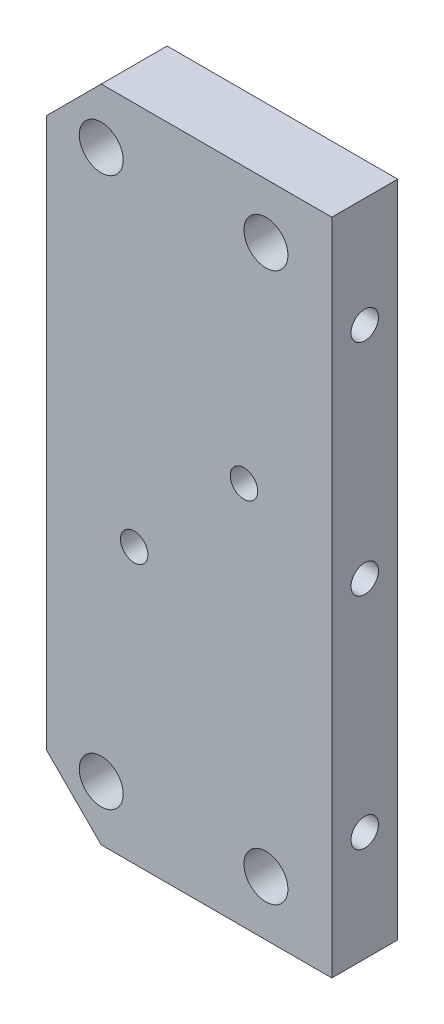
ISO-10303-21;
HEADER;
FILE_DESCRIPTION(('STEP AP214'),'2;1');
FILE_NAME('part.step','',(''),(''),'','','');
FILE_SCHEMA(('AUTOMOTIVE_DESIGN { 1 0 10303 214 1 1 1 1 }'));
ENDSEC;
DATA;
#1=APPLICATION_CONTEXT('core data for automotive mechanical design processes');
#2=APPLICATION_PROTOCOL_DEFINITION('international standard','automotive_design',2000,#1);
#3=PRODUCT_CONTEXT('',#1,'mechanical');
#4=PRODUCT('Part','Part','',(#3));
#5=PRODUCT_RELATED_PRODUCT_CATEGORY('part','',(#4));
#6=PRODUCT_DEFINITION_FORMATION('','',#4);
#7=PRODUCT_DEFINITION_CONTEXT('part definition',#1,'design');
#8=PRODUCT_DEFINITION('design','',#6,#7);
#9=PRODUCT_DEFINITION_SHAPE('','',#8);
#10=(LENGTH_UNIT() NAMED_UNIT(*) SI_UNIT(.MILLI.,.METRE.));
#11=(NAMED_UNIT(*) PLANE_ANGLE_UNIT() SI_UNIT($,.RADIAN.));
#12=(NAMED_UNIT(*) SI_UNIT($,.STERADIAN.) SOLID_ANGLE_UNIT());
#13=UNCERTAINTY_MEASURE_WITH_UNIT(LENGTH_MEASURE(1.E-05),#10,'distance_accuracy_value','');
#14=(GEOMETRIC_REPRESENTATION_CONTEXT(3) GLOBAL_UNCERTAINTY_ASSIGNED_CONTEXT((#13)) GLOBAL_UNIT_ASSIGNED_CONTEXT((#10,
#11,#12)) REPRESENTATION_CONTEXT('',''));
#15=CARTESIAN_POINT('',(0.,0.,0.));
#16=DIRECTION('',(0.,0.,1.));
#17=DIRECTION('',(1.,0.,0.));
#18=AXIS2_PLACEMENT_3D('',#15,#16,#17);
#19=CARTESIAN_POINT('',(-13.,-30.,6.));
#20=DIRECTION('',(1.,0.,0.));
#21=DIRECTION('',(0.,0.,-1.));
#22=AXIS2_PLACEMENT_3D('',#19,#20,#21);
#23=PLANE('',#22);
#24=DIRECTION('',(0.,-1.,0.));
#25=VECTOR('',#24,1.);
#26=CARTESIAN_POINT('',(-13.,-30.,6.));
#27=LINE('',#26,#25);
#28=CARTESIAN_POINT('',(-13.,25.,6.));
#29=VERTEX_POINT('',#28);
#30=CARTESIAN_POINT('',(-13.,-25.,6.));
#31=VERTEX_POINT('',#30);
#32=EDGE_CURVE('E179',#29,#31,#27,.T.);
#33=ORIENTED_EDGE('',*,*,#32,.F.);
#34=DIRECTION('',(0.,0.,-1.));
#35=VECTOR('',#34,1.);
#36=CARTESIAN_POINT('',(-13.,25.,6.));
#37=LINE('',#36,#35);
#38=CARTESIAN_POINT('',(-13.,25.,0.));
#39=VERTEX_POINT('',#38);
#40=EDGE_CURVE('E214',#29,#39,#37,.T.);
#41=ORIENTED_EDGE('',*,*,#40,.T.);
#42=DIRECTION('',(0.,-1.,0.));
#43=VECTOR('',#42,1.);
#44=CARTESIAN_POINT('',(-13.,-30.,0.));
#45=LINE('',#44,#43);
#46=CARTESIAN_POINT('',(-13.,-25.,0.));
#47=VERTEX_POINT('',#46);
#48=EDGE_CURVE('E178',#39,#47,#45,.T.);
#49=ORIENTED_EDGE('',*,*,#48,.T.);
#50=DIRECTION('',(0.,0.,1.));
#51=VECTOR('',#50,1.);
#52=CARTESIAN_POINT('',(-13.,-25.,6.));
#53=LINE('',#52,#51);
#54=EDGE_CURVE('E211',#47,#31,#53,.T.);
#55=ORIENTED_EDGE('',*,*,#54,.T.);
#56=EDGE_LOOP('',(#33,#41,#49,#55));
#57=FACE_BOUND('',#56,.T.);
#58=ADVANCED_FACE('F44',(#57),#23,.F.);
#59=CARTESIAN_POINT('',(13.,-30.,6.));
#60=DIRECTION('',(0.,1.,0.));
#61=DIRECTION('',(0.,0.,1.));
#62=AXIS2_PLACEMENT_3D('',#59,#60,#61);
#63=PLANE('',#62);
#64=DIRECTION('',(1.,0.,0.));
#65=VECTOR('',#64,1.);
#66=CARTESIAN_POINT('',(13.,-30.,6.));
#67=LINE('',#66,#65);
#68=CARTESIAN_POINT('',(-7.99999999999999,-30.,6.));
#69=VERTEX_POINT('',#68);
#70=CARTESIAN_POINT('',(13.,-30.,6.));
#71=VERTEX_POINT('',#70);
#72=EDGE_CURVE('E182',#69,#71,#67,.T.);
#73=ORIENTED_EDGE('',*,*,#72,.F.);
#74=DIRECTION('',(0.,0.,-1.));
#75=VECTOR('',#74,1.);
#76=CARTESIAN_POINT('',(-8.,-30.,6.));
#77=LINE('',#76,#75);
#78=CARTESIAN_POINT('',(-7.99999999999999,-30.,0.));
#79=VERTEX_POINT('',#78);
#80=EDGE_CURVE('E11',#69,#79,#77,.T.);
#81=ORIENTED_EDGE('',*,*,#80,.T.);
#82=DIRECTION('',(1.,0.,0.));
#83=VECTOR('',#82,1.);
#84=CARTESIAN_POINT('',(13.,-30.,0.));
#85=LINE('',#84,#83);
#86=CARTESIAN_POINT('',(13.,-30.,0.));
#87=VERTEX_POINT('',#86);
#88=EDGE_CURVE('E196',#79,#87,#85,.T.);
#89=ORIENTED_EDGE('',*,*,#88,.T.);
#90=DIRECTION('',(0.,0.,-1.));
#91=VECTOR('',#90,1.);
#92=CARTESIAN_POINT('',(13.,-30.,6.));
#93=LINE('',#92,#91);
#94=EDGE_CURVE('E207',#71,#87,#93,.T.);
#95=ORIENTED_EDGE('',*,*,#94,.F.);
#96=EDGE_LOOP('',(#73,#81,#89,#95));
#97=FACE_BOUND('',#96,.T.);
#98=ADVANCED_FACE('F249',(#97),#63,.F.);
#99=CARTESIAN_POINT('',(13.,-30.,6.));
#100=DIRECTION('',(-1.,0.,0.));
#101=DIRECTION('',(0.,0.,1.));
#102=AXIS2_PLACEMENT_3D('',#99,#100,#101);
#103=PLANE('',#102);
#104=CARTESIAN_POINT('',(13.,20.,2.99999999999999));
#105=DIRECTION('',(1.,0.,0.));
#106=DIRECTION('',(0.,0.,-1.));
#107=AXIS2_PLACEMENT_3D('',#104,#105,#106);
#108=CIRCLE('',#107,1.24999999999999);
#109=CARTESIAN_POINT('',(13.,20.,1.75));
#110=VERTEX_POINT('',#109);
#111=EDGE_CURVE('E121',#110,#110,#108,.T.);
#112=ORIENTED_EDGE('',*,*,#111,.F.);
#113=EDGE_LOOP('',(#112));
#114=FACE_BOUND('',#113,.T.);
#115=CARTESIAN_POINT('',(13.,0.,2.99999999999999));
#116=DIRECTION('',(1.,0.,0.));
#117=DIRECTION('',(0.,0.,-1.));
#118=AXIS2_PLACEMENT_3D('',#115,#116,#117);
#119=CIRCLE('',#118,1.24999999999999);
#120=CARTESIAN_POINT('',(13.,0.,1.75));
#121=VERTEX_POINT('',#120);
#122=EDGE_CURVE('E120',#121,#121,#119,.T.);
#123=ORIENTED_EDGE('',*,*,#122,.F.);
#124=EDGE_LOOP('',(#123));
#125=FACE_BOUND('',#124,.T.);
#126=CARTESIAN_POINT('',(13.,-20.,2.99999999999999));
#127=DIRECTION('',(1.,0.,0.));
#128=DIRECTION('',(0.,0.,-1.));
#129=AXIS2_PLACEMENT_3D('',#126,#127,#128);
#130=CIRCLE('',#129,1.24999999999999);
#131=CARTESIAN_POINT('',(13.,-20.,1.75));
#132=VERTEX_POINT('',#131);
#133=EDGE_CURVE('E139',#132,#132,#130,.T.);
#134=ORIENTED_EDGE('',*,*,#133,.F.);
#135=EDGE_LOOP('',(#134));
#136=FACE_BOUND('',#135,.T.);
#137=DIRECTION('',(0.,1.,0.));
#138=VECTOR('',#137,1.);
#139=CARTESIAN_POINT('',(13.,-30.,0.));
#140=LINE('',#139,#138);
#141=CARTESIAN_POINT('',(13.,30.,0.));
#142=VERTEX_POINT('',#141);
#143=EDGE_CURVE('E199',#87,#142,#140,.T.);
#144=ORIENTED_EDGE('',*,*,#143,.T.);
#145=DIRECTION('',(0.,0.,-1.));
#146=VECTOR('',#145,1.);
#147=CARTESIAN_POINT('',(13.,30.,6.));
#148=LINE('',#147,#146);
#149=CARTESIAN_POINT('',(13.,30.,6.));
#150=VERTEX_POINT('',#149);
#151=EDGE_CURVE('E192',#150,#142,#148,.T.);
#152=ORIENTED_EDGE('',*,*,#151,.F.);
#153=DIRECTION('',(0.,1.,0.));
#154=VECTOR('',#153,1.);
#155=CARTESIAN_POINT('',(13.,-30.,6.));
#156=LINE('',#155,#154);
#157=EDGE_CURVE('E186',#71,#150,#156,.T.);
#158=ORIENTED_EDGE('',*,*,#157,.F.);
#159=ORIENTED_EDGE('',*,*,#94,.T.);
#160=EDGE_LOOP('',(#144,#152,#158,#159));
#161=FACE_BOUND('',#160,.T.);
#162=ADVANCED_FACE('F245',(#114,#125,#136,#161),#103,.F.);
#163=CARTESIAN_POINT('',(13.,30.,6.));
#164=DIRECTION('',(0.,-1.,0.));
#165=DIRECTION('',(1.,0.,0.));
#166=AXIS2_PLACEMENT_3D('',#163,#164,#165);
#167=PLANE('',#166);
#168=DIRECTION('',(-1.,0.,0.));
#169=VECTOR('',#168,1.);
#170=CARTESIAN_POINT('',(13.,30.,0.));
#171=LINE('',#170,#169);
#172=CARTESIAN_POINT('',(-7.99999999999997,30.,0.));
#173=VERTEX_POINT('',#172);
#174=EDGE_CURVE('E183',#142,#173,#171,.T.);
#175=ORIENTED_EDGE('',*,*,#174,.T.);
#176=DIRECTION('',(0.,0.,1.));
#177=VECTOR('',#176,1.);
#178=CARTESIAN_POINT('',(-7.99999999999998,30.,6.));
#179=LINE('',#178,#177);
#180=CARTESIAN_POINT('',(-7.99999999999997,30.,6.));
#181=VERTEX_POINT('',#180);
#182=EDGE_CURVE('E69',#173,#181,#179,.T.);
#183=ORIENTED_EDGE('',*,*,#182,.T.);
#184=DIRECTION('',(-1.,0.,0.));
#185=VECTOR('',#184,1.);
#186=CARTESIAN_POINT('',(13.,30.,6.));
#187=LINE('',#186,#185);
#188=EDGE_CURVE('E189',#150,#181,#187,.T.);
#189=ORIENTED_EDGE('',*,*,#188,.F.);
#190=ORIENTED_EDGE('',*,*,#151,.T.);
#191=EDGE_LOOP('',(#175,#183,#189,#190));
#192=FACE_BOUND('',#191,.T.);
#193=ADVANCED_FACE('F241',(#192),#167,.F.);
#194=CARTESIAN_POINT('',(0.,0.,6.));
#195=DIRECTION('',(0.,0.,1.));
#196=DIRECTION('',(1.,0.,0.));
#197=AXIS2_PLACEMENT_3D('',#194,#195,#196);
#198=PLANE('',#197);
#199=CARTESIAN_POINT('',(5.00000000000293,5.00000000001032,6.));
#200=DIRECTION('',(0.,0.,1.));
#201=DIRECTION('',(1.,0.,0.));
#202=AXIS2_PLACEMENT_3D('',#199,#200,#201);
#203=CIRCLE('',#202,1.24999999999999);
#204=CARTESIAN_POINT('',(6.25000000000292,5.00000000001032,6.));
#205=VERTEX_POINT('',#204);
#206=EDGE_CURVE('E319',#205,#205,#203,.T.);
#207=ORIENTED_EDGE('',*,*,#206,.F.);
#208=EDGE_LOOP('',(#207));
#209=FACE_BOUND('',#208,.T.);
#210=CARTESIAN_POINT('',(-4.99999999999702,-4.99999999998973,6.));
#211=DIRECTION('',(0.,0.,1.));
#212=DIRECTION('',(1.,0.,0.));
#213=AXIS2_PLACEMENT_3D('',#210,#211,#212);
#214=CIRCLE('',#213,1.24999999999999);
#215=CARTESIAN_POINT('',(-3.74999999999704,-4.99999999998973,6.));
#216=VERTEX_POINT('',#215);
#217=EDGE_CURVE('E323',#216,#216,#214,.T.);
#218=ORIENTED_EDGE('',*,*,#217,.F.);
#219=EDGE_LOOP('',(#218));
#220=FACE_BOUND('',#219,.T.);
#221=CARTESIAN_POINT('',(6.99999999999981,-25.,6.));
#222=DIRECTION('',(0.,0.,1.));
#223=DIRECTION('',(1.,0.,0.));
#224=AXIS2_PLACEMENT_3D('',#221,#222,#223);
#225=CIRCLE('',#224,2.);
#226=CARTESIAN_POINT('',(8.99999999999981,-25.,6.));
#227=VERTEX_POINT('',#226);
#228=EDGE_CURVE('E152',#227,#227,#225,.F.);
#229=ORIENTED_EDGE('',*,*,#228,.T.);
#230=EDGE_LOOP('',(#229));
#231=FACE_BOUND('',#230,.T.);
#232=CARTESIAN_POINT('',(-8.00000000000002,25.,6.));
#233=DIRECTION('',(0.,0.,1.));
#234=DIRECTION('',(1.,0.,0.));
#235=AXIS2_PLACEMENT_3D('',#232,#233,#234);
#236=CIRCLE('',#235,2.);
#237=CARTESIAN_POINT('',(-6.00000000000002,25.,6.));
#238=VERTEX_POINT('',#237);
#239=EDGE_CURVE('E153',#238,#238,#236,.F.);
#240=ORIENTED_EDGE('',*,*,#239,.T.);
#241=EDGE_LOOP('',(#240));
#242=FACE_BOUND('',#241,.T.);
#243=CARTESIAN_POINT('',(6.99999999999997,25.,6.));
#244=DIRECTION('',(0.,0.,1.));
#245=DIRECTION('',(1.,0.,0.));
#246=AXIS2_PLACEMENT_3D('',#243,#244,#245);
#247=CIRCLE('',#246,2.);
#248=CARTESIAN_POINT('',(8.99999999999997,25.,6.));
#249=VERTEX_POINT('',#248);
#250=EDGE_CURVE('E162',#249,#249,#247,.F.);
#251=ORIENTED_EDGE('',*,*,#250,.T.);
#252=EDGE_LOOP('',(#251));
#253=FACE_BOUND('',#252,.T.);
#254=CARTESIAN_POINT('',(-8.00000000000018,-25.,6.));
#255=DIRECTION('',(0.,0.,1.));
#256=DIRECTION('',(1.,0.,0.));
#257=AXIS2_PLACEMENT_3D('',#254,#255,#256);
#258=CIRCLE('',#257,2.);
#259=CARTESIAN_POINT('',(-6.00000000000018,-25.,6.));
#260=VERTEX_POINT('',#259);
#261=EDGE_CURVE('E174',#260,#260,#258,.F.);
#262=ORIENTED_EDGE('',*,*,#261,.T.);
#263=EDGE_LOOP('',(#262));
#264=FACE_BOUND('',#263,.T.);
#265=ORIENTED_EDGE('',*,*,#188,.T.);
#266=DIRECTION('',(0.707106781186549,0.707106781186546,0.));
#267=VECTOR('',#266,1.);
#268=CARTESIAN_POINT('',(-19.,19.0000000000001,6.));
#269=LINE('',#268,#267);
#270=EDGE_CURVE('E54',#181,#29,#269,.F.);
#271=ORIENTED_EDGE('',*,*,#270,.T.);
#272=ORIENTED_EDGE('',*,*,#32,.T.);
#273=DIRECTION('',(-0.707106781186547,0.707106781186549,0.));
#274=VECTOR('',#273,1.);
#275=CARTESIAN_POINT('',(-19.,-19.,6.));
#276=LINE('',#275,#274);
#277=EDGE_CURVE('E61',#31,#69,#276,.F.);
#278=ORIENTED_EDGE('',*,*,#277,.T.);
#279=ORIENTED_EDGE('',*,*,#72,.T.);
#280=ORIENTED_EDGE('',*,*,#157,.T.);
#281=EDGE_LOOP('',(#265,#271,#272,#278,#279,#280));
#282=FACE_BOUND('',#281,.T.);
#283=ADVANCED_FACE('F230',(#209,#220,#231,#242,#253,#264,#282),#198,.T.);
#284=CARTESIAN_POINT('',(0.,0.,0.));
#285=DIRECTION('',(0.,0.,1.));
#286=DIRECTION('',(1.,0.,0.));
#287=AXIS2_PLACEMENT_3D('',#284,#285,#286);
#288=PLANE('',#287);
#289=CARTESIAN_POINT('',(5.00000000000293,5.00000000001032,0.));
#290=DIRECTION('',(0.,0.,1.));
#291=DIRECTION('',(1.,0.,0.));
#292=AXIS2_PLACEMENT_3D('',#289,#290,#291);
#293=CIRCLE('',#292,1.24999999999999);
#294=CARTESIAN_POINT('',(6.25000000000291,5.00000000001032,0.));
#295=VERTEX_POINT('',#294);
#296=EDGE_CURVE('E48',#295,#295,#293,.T.);
#297=ORIENTED_EDGE('',*,*,#296,.T.);
#298=EDGE_LOOP('',(#297));
#299=FACE_BOUND('',#298,.T.);
#300=CARTESIAN_POINT('',(-4.99999999999702,-4.99999999998973,0.));
#301=DIRECTION('',(0.,0.,1.));
#302=DIRECTION('',(1.,0.,0.));
#303=AXIS2_PLACEMENT_3D('',#300,#301,#302);
#304=CIRCLE('',#303,1.24999999999999);
#305=CARTESIAN_POINT('',(-3.74999999999704,-4.99999999998973,0.));
#306=VERTEX_POINT('',#305);
#307=EDGE_CURVE('E132',#306,#306,#304,.T.);
#308=ORIENTED_EDGE('',*,*,#307,.T.);
#309=EDGE_LOOP('',(#308));
#310=FACE_BOUND('',#309,.T.);
#311=CARTESIAN_POINT('',(6.99999999999981,-25.,0.));
#312=DIRECTION('',(0.,0.,-1.));
#313=DIRECTION('',(-1.,0.,0.));
#314=AXIS2_PLACEMENT_3D('',#311,#312,#313);
#315=CIRCLE('',#314,2.);
#316=CARTESIAN_POINT('',(4.99999999999981,-25.,0.));
#317=VERTEX_POINT('',#316);
#318=EDGE_CURVE('E148',#317,#317,#315,.T.);
#319=ORIENTED_EDGE('',*,*,#318,.F.);
#320=EDGE_LOOP('',(#319));
#321=FACE_BOUND('',#320,.T.);
#322=CARTESIAN_POINT('',(-8.00000000000002,25.,0.));
#323=DIRECTION('',(0.,0.,-1.));
#324=DIRECTION('',(-1.,0.,0.));
#325=AXIS2_PLACEMENT_3D('',#322,#323,#324);
#326=CIRCLE('',#325,2.);
#327=CARTESIAN_POINT('',(-10.,25.,0.));
#328=VERTEX_POINT('',#327);
#329=EDGE_CURVE('E158',#328,#328,#326,.T.);
#330=ORIENTED_EDGE('',*,*,#329,.F.);
#331=EDGE_LOOP('',(#330));
#332=FACE_BOUND('',#331,.T.);
#333=CARTESIAN_POINT('',(6.99999999999997,25.,0.));
#334=DIRECTION('',(0.,0.,-1.));
#335=DIRECTION('',(-1.,0.,0.));
#336=AXIS2_PLACEMENT_3D('',#333,#334,#335);
#337=CIRCLE('',#336,2.);
#338=CARTESIAN_POINT('',(4.99999999999997,25.,0.));
#339=VERTEX_POINT('',#338);
#340=EDGE_CURVE('E147',#339,#339,#337,.T.);
#341=ORIENTED_EDGE('',*,*,#340,.F.);
#342=EDGE_LOOP('',(#341));
#343=FACE_BOUND('',#342,.T.);
#344=CARTESIAN_POINT('',(-8.00000000000018,-25.,0.));
#345=DIRECTION('',(0.,0.,-1.));
#346=DIRECTION('',(-1.,0.,0.));
#347=AXIS2_PLACEMENT_3D('',#344,#345,#346);
#348=CIRCLE('',#347,2.);
#349=CARTESIAN_POINT('',(-10.0000000000002,-25.,0.));
#350=VERTEX_POINT('',#349);
#351=EDGE_CURVE('E157',#350,#350,#348,.T.);
#352=ORIENTED_EDGE('',*,*,#351,.F.);
#353=EDGE_LOOP('',(#352));
#354=FACE_BOUND('',#353,.T.);
#355=ORIENTED_EDGE('',*,*,#48,.F.);
#356=DIRECTION('',(-0.707106781186549,-0.707106781186546,0.));
#357=VECTOR('',#356,1.);
#358=CARTESIAN_POINT('',(-13.,25.,0.));
#359=LINE('',#358,#357);
#360=EDGE_CURVE('E220',#39,#173,#359,.F.);
#361=ORIENTED_EDGE('',*,*,#360,.T.);
#362=ORIENTED_EDGE('',*,*,#174,.F.);
#363=ORIENTED_EDGE('',*,*,#143,.F.);
#364=ORIENTED_EDGE('',*,*,#88,.F.);
#365=DIRECTION('',(0.707106781186547,-0.707106781186549,0.));
#366=VECTOR('',#365,1.);
#367=CARTESIAN_POINT('',(-8.,-30.,0.));
#368=LINE('',#367,#366);
#369=EDGE_CURVE('E218',#79,#47,#368,.F.);
#370=ORIENTED_EDGE('',*,*,#369,.T.);
#371=EDGE_LOOP('',(#355,#361,#362,#363,#364,#370));
#372=FACE_BOUND('',#371,.T.);
#373=ADVANCED_FACE('F239',(#299,#310,#321,#332,#343,#354,#372),#288,.F.);
#374=CARTESIAN_POINT('',(-8.00000000000018,-25.,11.6568542494924));
#375=DIRECTION('',(0.,0.,-1.));
#376=DIRECTION('',(-1.,0.,0.));
#377=AXIS2_PLACEMENT_3D('',#374,#375,#376);
#378=CYLINDRICAL_SURFACE('',#377,2.);
#379=ORIENTED_EDGE('',*,*,#351,.T.);
#380=EDGE_LOOP('',(#379));
#381=FACE_BOUND('',#380,.T.);
#382=ORIENTED_EDGE('',*,*,#261,.F.);
#383=EDGE_LOOP('',(#382));
#384=FACE_BOUND('',#383,.T.);
#385=ADVANCED_FACE('F275',(#381,#384),#378,.F.);
#386=CARTESIAN_POINT('',(6.99999999999997,25.,11.6568542494924));
#387=DIRECTION('',(0.,0.,-1.));
#388=DIRECTION('',(-1.,0.,0.));
#389=AXIS2_PLACEMENT_3D('',#386,#387,#388);
#390=CYLINDRICAL_SURFACE('',#389,2.);
#391=ORIENTED_EDGE('',*,*,#340,.T.);
#392=EDGE_LOOP('',(#391));
#393=FACE_BOUND('',#392,.T.);
#394=ORIENTED_EDGE('',*,*,#250,.F.);
#395=EDGE_LOOP('',(#394));
#396=FACE_BOUND('',#395,.T.);
#397=ADVANCED_FACE('F282',(#393,#396),#390,.F.);
#398=CARTESIAN_POINT('',(-8.00000000000002,25.,11.6568542494924));
#399=DIRECTION('',(0.,0.,-1.));
#400=DIRECTION('',(-1.,0.,0.));
#401=AXIS2_PLACEMENT_3D('',#398,#399,#400);
#402=CYLINDRICAL_SURFACE('',#401,2.);
#403=ORIENTED_EDGE('',*,*,#329,.T.);
#404=EDGE_LOOP('',(#403));
#405=FACE_BOUND('',#404,.T.);
#406=ORIENTED_EDGE('',*,*,#239,.F.);
#407=EDGE_LOOP('',(#406));
#408=FACE_BOUND('',#407,.T.);
#409=ADVANCED_FACE('F286',(#405,#408),#402,.F.);
#410=CARTESIAN_POINT('',(6.99999999999981,-25.,11.6568542494924));
#411=DIRECTION('',(0.,0.,-1.));
#412=DIRECTION('',(-1.,0.,0.));
#413=AXIS2_PLACEMENT_3D('',#410,#411,#412);
#414=CYLINDRICAL_SURFACE('',#413,2.);
#415=ORIENTED_EDGE('',*,*,#318,.T.);
#416=EDGE_LOOP('',(#415));
#417=FACE_BOUND('',#416,.T.);
#418=ORIENTED_EDGE('',*,*,#228,.F.);
#419=EDGE_LOOP('',(#418));
#420=FACE_BOUND('',#419,.T.);
#421=ADVANCED_FACE('F290',(#417,#420),#414,.F.);
#422=CARTESIAN_POINT('',(5.5,-20.,2.99999999999999));
#423=DIRECTION('',(1.,0.,0.));
#424=DIRECTION('',(0.,0.,-1.));
#425=AXIS2_PLACEMENT_3D('',#422,#423,#424);
#426=CONICAL_SURFACE('',#425,1.24999999999999,1.02974425867665);
#427=CARTESIAN_POINT('',(4.74892422621555,-20.,2.99999999999999));
#428=VERTEX_POINT('',#427);
#429=VERTEX_LOOP('',#428);
#430=FACE_BOUND('',#429,.T.);
#431=CARTESIAN_POINT('',(5.5,-20.,2.99999999999999));
#432=DIRECTION('',(1.,0.,0.));
#433=DIRECTION('',(0.,0.,-1.));
#434=AXIS2_PLACEMENT_3D('',#431,#432,#433);
#435=CIRCLE('',#434,1.24999999999999);
#436=CARTESIAN_POINT('',(5.5,-20.,1.75));
#437=VERTEX_POINT('',#436);
#438=EDGE_CURVE('E143',#437,#437,#435,.T.);
#439=ORIENTED_EDGE('',*,*,#438,.T.);
#440=EDGE_LOOP('',(#439));
#441=FACE_BOUND('',#440,.T.);
#442=ADVANCED_FACE('F294',(#430,#441),#426,.F.);
#443=CARTESIAN_POINT('',(13.,-20.,2.99999999999999));
#444=DIRECTION('',(1.,0.,0.));
#445=DIRECTION('',(0.,0.,-1.));
#446=AXIS2_PLACEMENT_3D('',#443,#444,#445);
#447=CYLINDRICAL_SURFACE('',#446,1.24999999999999);
#448=ORIENTED_EDGE('',*,*,#438,.F.);
#449=EDGE_LOOP('',(#448));
#450=FACE_BOUND('',#449,.T.);
#451=ORIENTED_EDGE('',*,*,#133,.T.);
#452=EDGE_LOOP('',(#451));
#453=FACE_BOUND('',#452,.T.);
#454=ADVANCED_FACE('F298',(#450,#453),#447,.F.);
#455=CARTESIAN_POINT('',(5.5,0.,2.99999999999999));
#456=DIRECTION('',(1.,0.,0.));
#457=DIRECTION('',(0.,0.,-1.));
#458=AXIS2_PLACEMENT_3D('',#455,#456,#457);
#459=CONICAL_SURFACE('',#458,1.24999999999999,1.02974425867665);
#460=CARTESIAN_POINT('',(4.74892422621555,0.,2.99999999999999));
#461=VERTEX_POINT('',#460);
#462=VERTEX_LOOP('',#461);
#463=FACE_BOUND('',#462,.T.);
#464=CARTESIAN_POINT('',(5.5,0.,2.99999999999999));
#465=DIRECTION('',(1.,0.,0.));
#466=DIRECTION('',(0.,0.,-1.));
#467=AXIS2_PLACEMENT_3D('',#464,#465,#466);
#468=CIRCLE('',#467,1.24999999999999);
#469=CARTESIAN_POINT('',(5.5,0.,1.75));
#470=VERTEX_POINT('',#469);
#471=EDGE_CURVE('E128',#470,#470,#468,.T.);
#472=ORIENTED_EDGE('',*,*,#471,.T.);
#473=EDGE_LOOP('',(#472));
#474=FACE_BOUND('',#473,.T.);
#475=ADVANCED_FACE('F302',(#463,#474),#459,.F.);
#476=CARTESIAN_POINT('',(13.,0.,2.99999999999999));
#477=DIRECTION('',(1.,0.,0.));
#478=DIRECTION('',(0.,0.,-1.));
#479=AXIS2_PLACEMENT_3D('',#476,#477,#478);
#480=CYLINDRICAL_SURFACE('',#479,1.24999999999999);
#481=ORIENTED_EDGE('',*,*,#471,.F.);
#482=EDGE_LOOP('',(#481));
#483=FACE_BOUND('',#482,.T.);
#484=ORIENTED_EDGE('',*,*,#122,.T.);
#485=EDGE_LOOP('',(#484));
#486=FACE_BOUND('',#485,.T.);
#487=ADVANCED_FACE('F113',(#483,#486),#480,.F.);
#488=CARTESIAN_POINT('',(5.5,20.,2.99999999999999));
#489=DIRECTION('',(1.,0.,0.));
#490=DIRECTION('',(0.,0.,-1.));
#491=AXIS2_PLACEMENT_3D('',#488,#489,#490);
#492=CONICAL_SURFACE('',#491,1.24999999999999,1.02974425867665);
#493=CARTESIAN_POINT('',(4.74892422621555,20.,2.99999999999999));
#494=VERTEX_POINT('',#493);
#495=VERTEX_LOOP('',#494);
#496=FACE_BOUND('',#495,.T.);
#497=CARTESIAN_POINT('',(5.5,20.,2.99999999999999));
#498=DIRECTION('',(1.,0.,0.));
#499=DIRECTION('',(0.,0.,-1.));
#500=AXIS2_PLACEMENT_3D('',#497,#498,#499);
#501=CIRCLE('',#500,1.24999999999999);
#502=CARTESIAN_POINT('',(5.5,20.,1.75));
#503=VERTEX_POINT('',#502);
#504=EDGE_CURVE('E117',#503,#503,#501,.T.);
#505=ORIENTED_EDGE('',*,*,#504,.T.);
#506=EDGE_LOOP('',(#505));
#507=FACE_BOUND('',#506,.T.);
#508=ADVANCED_FACE('F109',(#496,#507),#492,.F.);
#509=CARTESIAN_POINT('',(13.,20.,2.99999999999999));
#510=DIRECTION('',(1.,0.,0.));
#511=DIRECTION('',(0.,0.,-1.));
#512=AXIS2_PLACEMENT_3D('',#509,#510,#511);
#513=CYLINDRICAL_SURFACE('',#512,1.24999999999999);
#514=ORIENTED_EDGE('',*,*,#504,.F.);
#515=EDGE_LOOP('',(#514));
#516=FACE_BOUND('',#515,.T.);
#517=ORIENTED_EDGE('',*,*,#111,.T.);
#518=EDGE_LOOP('',(#517));
#519=FACE_BOUND('',#518,.T.);
#520=ADVANCED_FACE('F112',(#516,#519),#513,.F.);
#521=CARTESIAN_POINT('',(-13.,25.,6.));
#522=DIRECTION('',(0.707106781186546,-0.707106781186549,0.));
#523=DIRECTION('',(0.,0.,-1.));
#524=AXIS2_PLACEMENT_3D('',#521,#522,#523);
#525=PLANE('',#524);
#526=ORIENTED_EDGE('',*,*,#270,.F.);
#527=ORIENTED_EDGE('',*,*,#182,.F.);
#528=ORIENTED_EDGE('',*,*,#360,.F.);
#529=ORIENTED_EDGE('',*,*,#40,.F.);
#530=EDGE_LOOP('',(#526,#527,#528,#529));
#531=FACE_BOUND('',#530,.T.);
#532=ADVANCED_FACE('F236',(#531),#525,.F.);
#533=CARTESIAN_POINT('',(-8.,-30.,6.));
#534=DIRECTION('',(0.707106781186548,0.707106781186546,0.));
#535=DIRECTION('',(0.,0.,-1.));
#536=AXIS2_PLACEMENT_3D('',#533,#534,#535);
#537=PLANE('',#536);
#538=ORIENTED_EDGE('',*,*,#277,.F.);
#539=ORIENTED_EDGE('',*,*,#54,.F.);
#540=ORIENTED_EDGE('',*,*,#369,.F.);
#541=ORIENTED_EDGE('',*,*,#80,.F.);
#542=EDGE_LOOP('',(#538,#539,#540,#541));
#543=FACE_BOUND('',#542,.T.);
#544=ADVANCED_FACE('F46',(#543),#537,.F.);
#545=CARTESIAN_POINT('',(-4.99999999999702,-4.99999999998973,6.));
#546=DIRECTION('',(0.,0.,1.));
#547=DIRECTION('',(1.,0.,0.));
#548=AXIS2_PLACEMENT_3D('',#545,#546,#547);
#549=CYLINDRICAL_SURFACE('',#548,1.24999999999999);
#550=ORIENTED_EDGE('',*,*,#217,.T.);
#551=EDGE_LOOP('',(#550));
#552=FACE_BOUND('',#551,.T.);
#553=ORIENTED_EDGE('',*,*,#307,.F.);
#554=EDGE_LOOP('',(#553));
#555=FACE_BOUND('',#554,.T.);
#556=ADVANCED_FACE('F253',(#552,#555),#549,.F.);
#557=CARTESIAN_POINT('',(5.00000000000293,5.00000000001032,6.));
#558=DIRECTION('',(0.,0.,1.));
#559=DIRECTION('',(1.,0.,0.));
#560=AXIS2_PLACEMENT_3D('',#557,#558,#559);
#561=CYLINDRICAL_SURFACE('',#560,1.24999999999999);
#562=ORIENTED_EDGE('',*,*,#206,.T.);
#563=EDGE_LOOP('',(#562));
#564=FACE_BOUND('',#563,.T.);
#565=ORIENTED_EDGE('',*,*,#296,.F.);
#566=EDGE_LOOP('',(#565));
#567=FACE_BOUND('',#566,.T.);
#568=ADVANCED_FACE('F258',(#564,#567),#561,.F.);
#569=CLOSED_SHELL('',(#58,#98,#162,#193,#283,#373,#385,#397,#409,#421,#442,#454,#475,#487,#508,
#520,#532,#544,#556,#568));
#570=MANIFOLD_SOLID_BREP('B2',#569);
#571=ADVANCED_BREP_SHAPE_REPRESENTATION('',(#18,#570),#14);
#572=SHAPE_DEFINITION_REPRESENTATION(#9,#571);
ENDSEC;
END-ISO-10303-21;
